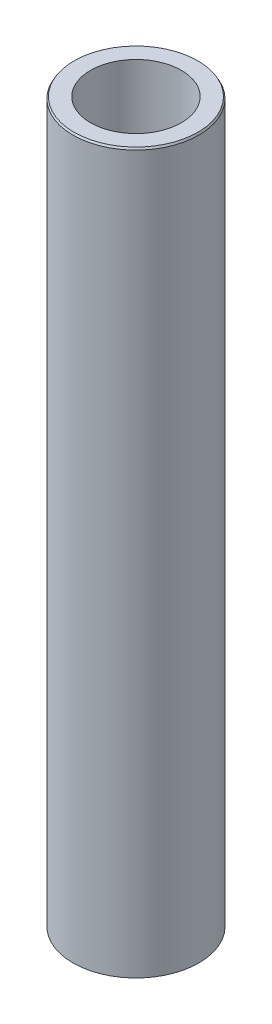
ISO-10303-21;
HEADER;
FILE_DESCRIPTION(('STEP AP214'),'2;1');
FILE_NAME('part.step','',(''),(''),'','','');
FILE_SCHEMA(('AUTOMOTIVE_DESIGN { 1 0 10303 214 1 1 1 1 }'));
ENDSEC;
DATA;
#1=APPLICATION_CONTEXT('core data for automotive mechanical design processes');
#2=APPLICATION_PROTOCOL_DEFINITION('international standard','automotive_design',2000,#1);
#3=PRODUCT_CONTEXT('',#1,'mechanical');
#4=PRODUCT('Part','Part','',(#3));
#5=PRODUCT_RELATED_PRODUCT_CATEGORY('part','',(#4));
#6=PRODUCT_DEFINITION_FORMATION('','',#4);
#7=PRODUCT_DEFINITION_CONTEXT('part definition',#1,'design');
#8=PRODUCT_DEFINITION('design','',#6,#7);
#9=PRODUCT_DEFINITION_SHAPE('','',#8);
#10=(LENGTH_UNIT() NAMED_UNIT(*) SI_UNIT(.MILLI.,.METRE.));
#11=(NAMED_UNIT(*) PLANE_ANGLE_UNIT() SI_UNIT($,.RADIAN.));
#12=(NAMED_UNIT(*) SI_UNIT($,.STERADIAN.) SOLID_ANGLE_UNIT());
#13=UNCERTAINTY_MEASURE_WITH_UNIT(LENGTH_MEASURE(1.E-05),#10,'distance_accuracy_value','');
#14=(GEOMETRIC_REPRESENTATION_CONTEXT(3) GLOBAL_UNCERTAINTY_ASSIGNED_CONTEXT((#13)) GLOBAL_UNIT_ASSIGNED_CONTEXT((#10,
#11,#12)) REPRESENTATION_CONTEXT('',''));
#15=CARTESIAN_POINT('',(0.,0.,0.));
#16=DIRECTION('',(0.,0.,1.));
#17=DIRECTION('',(1.,0.,0.));
#18=AXIS2_PLACEMENT_3D('',#15,#16,#17);
#19=CARTESIAN_POINT('',(0.,600.,0.));
#20=DIRECTION('',(0.,-1.,0.));
#21=DIRECTION('',(0.,0.,-1.));
#22=AXIS2_PLACEMENT_3D('',#19,#20,#21);
#23=CYLINDRICAL_SURFACE('',#22,52.5);
#24=CARTESIAN_POINT('',(0.,598.42692347307,0.));
#25=DIRECTION('',(0.,1.,0.));
#26=DIRECTION('',(0.,0.,1.));
#27=AXIS2_PLACEMENT_3D('',#24,#25,#26);
#28=CIRCLE('',#27,52.5);
#29=CARTESIAN_POINT('',(0.,598.42692347307,52.5));
#30=VERTEX_POINT('',#29);
#31=EDGE_CURVE('E50',#30,#30,#28,.F.);
#32=ORIENTED_EDGE('',*,*,#31,.T.);
#33=EDGE_LOOP('',(#32));
#34=FACE_BOUND('',#33,.T.);
#35=CARTESIAN_POINT('',(0.,0.908216156279007,0.));
#36=DIRECTION('',(0.,1.,0.));
#37=DIRECTION('',(0.,0.,1.));
#38=AXIS2_PLACEMENT_3D('',#35,#36,#37);
#39=CIRCLE('',#38,52.5);
#40=CARTESIAN_POINT('',(0.,0.908216156279007,52.5));
#41=VERTEX_POINT('',#40);
#42=EDGE_CURVE('E51',#41,#41,#39,.T.);
#43=ORIENTED_EDGE('',*,*,#42,.T.);
#44=EDGE_LOOP('',(#43));
#45=FACE_BOUND('',#44,.T.);
#46=ADVANCED_FACE('F39',(#34,#45),#23,.T.);
#47=CARTESIAN_POINT('',(0.,600.,0.));
#48=DIRECTION('',(0.,1.,0.));
#49=DIRECTION('',(0.,0.,1.));
#50=AXIS2_PLACEMENT_3D('',#47,#48,#49);
#51=PLANE('',#50);
#52=CARTESIAN_POINT('',(0.,600.,0.));
#53=DIRECTION('',(0.,1.,0.));
#54=DIRECTION('',(0.,0.,1.));
#55=AXIS2_PLACEMENT_3D('',#52,#53,#54);
#56=CIRCLE('',#55,51.5917838437208);
#57=CARTESIAN_POINT('',(0.,600.,51.5917838437208));
#58=VERTEX_POINT('',#57);
#59=EDGE_CURVE('E54',#58,#58,#56,.T.);
#60=ORIENTED_EDGE('',*,*,#59,.T.);
#61=EDGE_LOOP('',(#60));
#62=FACE_BOUND('',#61,.T.);
#63=CARTESIAN_POINT('',(0.,600.,0.));
#64=DIRECTION('',(0.,1.,0.));
#65=DIRECTION('',(0.,0.,1.));
#66=AXIS2_PLACEMENT_3D('',#63,#64,#65);
#67=CIRCLE('',#66,37.8591716176492);
#68=CARTESIAN_POINT('',(0.,600.,37.8591716176492));
#69=VERTEX_POINT('',#68);
#70=EDGE_CURVE('E58',#69,#69,#67,.T.);
#71=ORIENTED_EDGE('',*,*,#70,.F.);
#72=EDGE_LOOP('',(#71));
#73=FACE_BOUND('',#72,.T.);
#74=ADVANCED_FACE('F69',(#62,#73),#51,.T.);
#75=CARTESIAN_POINT('',(0.,0.,0.));
#76=DIRECTION('',(0.,1.,0.));
#77=DIRECTION('',(0.,0.,1.));
#78=AXIS2_PLACEMENT_3D('',#75,#76,#77);
#79=PLANE('',#78);
#80=CARTESIAN_POINT('',(0.,0.,0.));
#81=DIRECTION('',(0.,1.,0.));
#82=DIRECTION('',(0.,0.,1.));
#83=AXIS2_PLACEMENT_3D('',#80,#81,#82);
#84=CIRCLE('',#83,50.9269234730697);
#85=CARTESIAN_POINT('',(0.,0.,50.9269234730697));
#86=VERTEX_POINT('',#85);
#87=EDGE_CURVE('E10',#86,#86,#84,.F.);
#88=ORIENTED_EDGE('',*,*,#87,.T.);
#89=EDGE_LOOP('',(#88));
#90=FACE_BOUND('',#89,.T.);
#91=CARTESIAN_POINT('',(0.,0.,0.));
#92=DIRECTION('',(0.,1.,0.));
#93=DIRECTION('',(0.,0.,1.));
#94=AXIS2_PLACEMENT_3D('',#91,#92,#93);
#95=CIRCLE('',#94,37.8591716176492);
#96=CARTESIAN_POINT('',(0.,0.,37.8591716176492));
#97=VERTEX_POINT('',#96);
#98=EDGE_CURVE('E63',#97,#97,#95,.T.);
#99=ORIENTED_EDGE('',*,*,#98,.T.);
#100=EDGE_LOOP('',(#99));
#101=FACE_BOUND('',#100,.T.);
#102=ADVANCED_FACE('F75',(#90,#101),#79,.F.);
#103=CARTESIAN_POINT('',(0.,600.,0.));
#104=DIRECTION('',(0.,-1.,0.));
#105=DIRECTION('',(0.,0.,-1.));
#106=AXIS2_PLACEMENT_3D('',#103,#104,#105);
#107=CYLINDRICAL_SURFACE('',#106,37.8591716176492);
#108=ORIENTED_EDGE('',*,*,#70,.T.);
#109=EDGE_LOOP('',(#108));
#110=FACE_BOUND('',#109,.T.);
#111=ORIENTED_EDGE('',*,*,#98,.F.);
#112=EDGE_LOOP('',(#111));
#113=FACE_BOUND('',#112,.T.);
#114=ADVANCED_FACE('F70',(#110,#113),#107,.F.);
#115=CARTESIAN_POINT('',(0.,600.,0.));
#116=DIRECTION('',(0.,-1.,0.));
#117=DIRECTION('',(0.,0.,-1.));
#118=AXIS2_PLACEMENT_3D('',#115,#116,#117);
#119=CONICAL_SURFACE('',#118,51.5917838437208,0.523598775598316);
#120=ORIENTED_EDGE('',*,*,#31,.F.);
#121=EDGE_LOOP('',(#120));
#122=FACE_BOUND('',#121,.T.);
#123=ORIENTED_EDGE('',*,*,#59,.F.);
#124=EDGE_LOOP('',(#123));
#125=FACE_BOUND('',#124,.T.);
#126=ADVANCED_FACE('F81',(#122,#125),#119,.T.);
#127=CARTESIAN_POINT('',(0.,0.908216156279007,0.));
#128=DIRECTION('',(0.,1.,0.));
#129=DIRECTION('',(0.,0.,1.));
#130=AXIS2_PLACEMENT_3D('',#127,#128,#129);
#131=CONICAL_SURFACE('',#130,52.5,1.04719755119663);
#132=ORIENTED_EDGE('',*,*,#87,.F.);
#133=EDGE_LOOP('',(#132));
#134=FACE_BOUND('',#133,.T.);
#135=ORIENTED_EDGE('',*,*,#42,.F.);
#136=EDGE_LOOP('',(#135));
#137=FACE_BOUND('',#136,.T.);
#138=ADVANCED_FACE('F45',(#134,#137),#131,.T.);
#139=CLOSED_SHELL('',(#46,#74,#102,#114,#126,#138));
#140=MANIFOLD_SOLID_BREP('B2',#139);
#141=ADVANCED_BREP_SHAPE_REPRESENTATION('',(#18,#140),#14);
#142=SHAPE_DEFINITION_REPRESENTATION(#9,#141);
ENDSEC;
END-ISO-10303-21;
